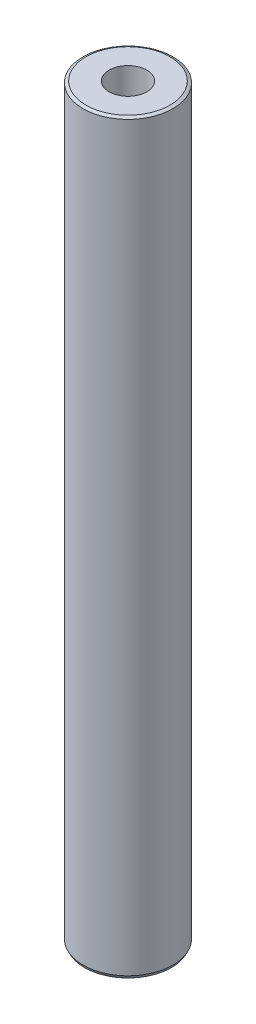
ISO-10303-21;
HEADER;
FILE_DESCRIPTION(('STEP AP214'),'2;1');
FILE_NAME('part.step','',(''),(''),'','','');
FILE_SCHEMA(('AUTOMOTIVE_DESIGN { 1 0 10303 214 1 1 1 1 }'));
ENDSEC;
DATA;
#1=APPLICATION_CONTEXT('core data for automotive mechanical design processes');
#2=APPLICATION_PROTOCOL_DEFINITION('international standard','automotive_design',2000,#1);
#3=PRODUCT_CONTEXT('',#1,'mechanical');
#4=PRODUCT('Part','Part','',(#3));
#5=PRODUCT_RELATED_PRODUCT_CATEGORY('part','',(#4));
#6=PRODUCT_DEFINITION_FORMATION('','',#4);
#7=PRODUCT_DEFINITION_CONTEXT('part definition',#1,'design');
#8=PRODUCT_DEFINITION('design','',#6,#7);
#9=PRODUCT_DEFINITION_SHAPE('','',#8);
#10=(LENGTH_UNIT() NAMED_UNIT(*) SI_UNIT(.MILLI.,.METRE.));
#11=(NAMED_UNIT(*) PLANE_ANGLE_UNIT() SI_UNIT($,.RADIAN.));
#12=(NAMED_UNIT(*) SI_UNIT($,.STERADIAN.) SOLID_ANGLE_UNIT());
#13=UNCERTAINTY_MEASURE_WITH_UNIT(LENGTH_MEASURE(1.E-05),#10,'distance_accuracy_value','');
#14=(GEOMETRIC_REPRESENTATION_CONTEXT(3) GLOBAL_UNCERTAINTY_ASSIGNED_CONTEXT((#13)) GLOBAL_UNIT_ASSIGNED_CONTEXT((#10,
#11,#12)) REPRESENTATION_CONTEXT('',''));
#15=CARTESIAN_POINT('',(0.,0.,0.));
#16=DIRECTION('',(0.,0.,1.));
#17=DIRECTION('',(1.,0.,0.));
#18=AXIS2_PLACEMENT_3D('',#15,#16,#17);
#19=CARTESIAN_POINT('',(0.,373.45482328877,0.));
#20=DIRECTION('',(0.,-1.,0.));
#21=DIRECTION('',(0.,0.,-1.));
#22=AXIS2_PLACEMENT_3D('',#19,#20,#21);
#23=CYLINDRICAL_SURFACE('',#22,22.5);
#24=CARTESIAN_POINT('',(0.,372.692726031474,0.));
#25=DIRECTION('',(0.,1.,0.));
#26=DIRECTION('',(0.,0.,1.));
#27=AXIS2_PLACEMENT_3D('',#24,#25,#26);
#28=CIRCLE('',#27,22.5);
#29=CARTESIAN_POINT('',(0.,372.692726031474,22.5));
#30=VERTEX_POINT('',#29);
#31=EDGE_CURVE('E50',#30,#30,#28,.F.);
#32=ORIENTED_EDGE('',*,*,#31,.T.);
#33=EDGE_LOOP('',(#32));
#34=FACE_BOUND('',#33,.T.);
#35=CARTESIAN_POINT('',(0.,1.49117177635866,0.));
#36=DIRECTION('',(0.,1.,0.));
#37=DIRECTION('',(0.,0.,1.));
#38=AXIS2_PLACEMENT_3D('',#35,#36,#37);
#39=CIRCLE('',#38,22.5);
#40=CARTESIAN_POINT('',(0.,1.49117177635866,22.5));
#41=VERTEX_POINT('',#40);
#42=EDGE_CURVE('E51',#41,#41,#39,.T.);
#43=ORIENTED_EDGE('',*,*,#42,.T.);
#44=EDGE_LOOP('',(#43));
#45=FACE_BOUND('',#44,.T.);
#46=ADVANCED_FACE('F39',(#34,#45),#23,.T.);
#47=CARTESIAN_POINT('',(0.,373.45482328877,0.));
#48=DIRECTION('',(0.,1.,0.));
#49=DIRECTION('',(0.,0.,1.));
#50=AXIS2_PLACEMENT_3D('',#47,#48,#49);
#51=PLANE('',#50);
#52=CARTESIAN_POINT('',(0.,373.45482328877,0.));
#53=DIRECTION('',(0.,1.,0.));
#54=DIRECTION('',(0.,0.,1.));
#55=AXIS2_PLACEMENT_3D('',#52,#53,#54);
#56=CIRCLE('',#55,21.0088282236414);
#57=CARTESIAN_POINT('',(0.,373.45482328877,21.0088282236414));
#58=VERTEX_POINT('',#57);
#59=EDGE_CURVE('E54',#58,#58,#56,.T.);
#60=ORIENTED_EDGE('',*,*,#59,.T.);
#61=EDGE_LOOP('',(#60));
#62=FACE_BOUND('',#61,.T.);
#63=CARTESIAN_POINT('',(0.,373.45482328877,0.));
#64=DIRECTION('',(0.,1.,0.));
#65=DIRECTION('',(0.,0.,1.));
#66=AXIS2_PLACEMENT_3D('',#63,#64,#65);
#67=CIRCLE('',#66,9.431710228012);
#68=CARTESIAN_POINT('',(0.,373.45482328877,9.431710228012));
#69=VERTEX_POINT('',#68);
#70=EDGE_CURVE('E58',#69,#69,#67,.T.);
#71=ORIENTED_EDGE('',*,*,#70,.F.);
#72=EDGE_LOOP('',(#71));
#73=FACE_BOUND('',#72,.T.);
#74=ADVANCED_FACE('F69',(#62,#73),#51,.T.);
#75=CARTESIAN_POINT('',(0.,0.,0.));
#76=DIRECTION('',(0.,1.,0.));
#77=DIRECTION('',(0.,0.,1.));
#78=AXIS2_PLACEMENT_3D('',#75,#76,#77);
#79=PLANE('',#78);
#80=CARTESIAN_POINT('',(0.,0.,0.));
#81=DIRECTION('',(0.,1.,0.));
#82=DIRECTION('',(0.,0.,1.));
#83=AXIS2_PLACEMENT_3D('',#80,#81,#82);
#84=CIRCLE('',#83,21.7379027427046);
#85=CARTESIAN_POINT('',(0.,0.,21.7379027427046));
#86=VERTEX_POINT('',#85);
#87=EDGE_CURVE('E10',#86,#86,#84,.F.);
#88=ORIENTED_EDGE('',*,*,#87,.T.);
#89=EDGE_LOOP('',(#88));
#90=FACE_BOUND('',#89,.T.);
#91=CARTESIAN_POINT('',(0.,0.,0.));
#92=DIRECTION('',(0.,1.,0.));
#93=DIRECTION('',(0.,0.,1.));
#94=AXIS2_PLACEMENT_3D('',#91,#92,#93);
#95=CIRCLE('',#94,9.431710228012);
#96=CARTESIAN_POINT('',(0.,0.,9.431710228012));
#97=VERTEX_POINT('',#96);
#98=EDGE_CURVE('E63',#97,#97,#95,.T.);
#99=ORIENTED_EDGE('',*,*,#98,.T.);
#100=EDGE_LOOP('',(#99));
#101=FACE_BOUND('',#100,.T.);
#102=ADVANCED_FACE('F75',(#90,#101),#79,.F.);
#103=CARTESIAN_POINT('',(0.,373.45482328877,0.));
#104=DIRECTION('',(0.,-1.,0.));
#105=DIRECTION('',(0.,0.,-1.));
#106=AXIS2_PLACEMENT_3D('',#103,#104,#105);
#107=CYLINDRICAL_SURFACE('',#106,9.431710228012);
#108=ORIENTED_EDGE('',*,*,#70,.T.);
#109=EDGE_LOOP('',(#108));
#110=FACE_BOUND('',#109,.T.);
#111=ORIENTED_EDGE('',*,*,#98,.F.);
#112=EDGE_LOOP('',(#111));
#113=FACE_BOUND('',#112,.T.);
#114=ADVANCED_FACE('F70',(#110,#113),#107,.F.);
#115=CARTESIAN_POINT('',(0.,373.45482328877,0.));
#116=DIRECTION('',(0.,-1.,0.));
#117=DIRECTION('',(0.,0.,-1.));
#118=AXIS2_PLACEMENT_3D('',#115,#116,#117);
#119=CONICAL_SURFACE('',#118,21.0088282236414,1.09832980896124);
#120=ORIENTED_EDGE('',*,*,#31,.F.);
#121=EDGE_LOOP('',(#120));
#122=FACE_BOUND('',#121,.T.);
#123=ORIENTED_EDGE('',*,*,#59,.F.);
#124=EDGE_LOOP('',(#123));
#125=FACE_BOUND('',#124,.T.);
#126=ADVANCED_FACE('F81',(#122,#125),#119,.T.);
#127=CARTESIAN_POINT('',(0.,1.49117177635866,0.));
#128=DIRECTION('',(0.,1.,0.));
#129=DIRECTION('',(0.,0.,1.));
#130=AXIS2_PLACEMENT_3D('',#127,#128,#129);
#131=CONICAL_SURFACE('',#130,22.5,0.472466517833686);
#132=ORIENTED_EDGE('',*,*,#87,.F.);
#133=EDGE_LOOP('',(#132));
#134=FACE_BOUND('',#133,.T.);
#135=ORIENTED_EDGE('',*,*,#42,.F.);
#136=EDGE_LOOP('',(#135));
#137=FACE_BOUND('',#136,.T.);
#138=ADVANCED_FACE('F45',(#134,#137),#131,.T.);
#139=CLOSED_SHELL('',(#46,#74,#102,#114,#126,#138));
#140=MANIFOLD_SOLID_BREP('B2',#139);
#141=ADVANCED_BREP_SHAPE_REPRESENTATION('',(#18,#140),#14);
#142=SHAPE_DEFINITION_REPRESENTATION(#9,#141);
ENDSEC;
END-ISO-10303-21;
